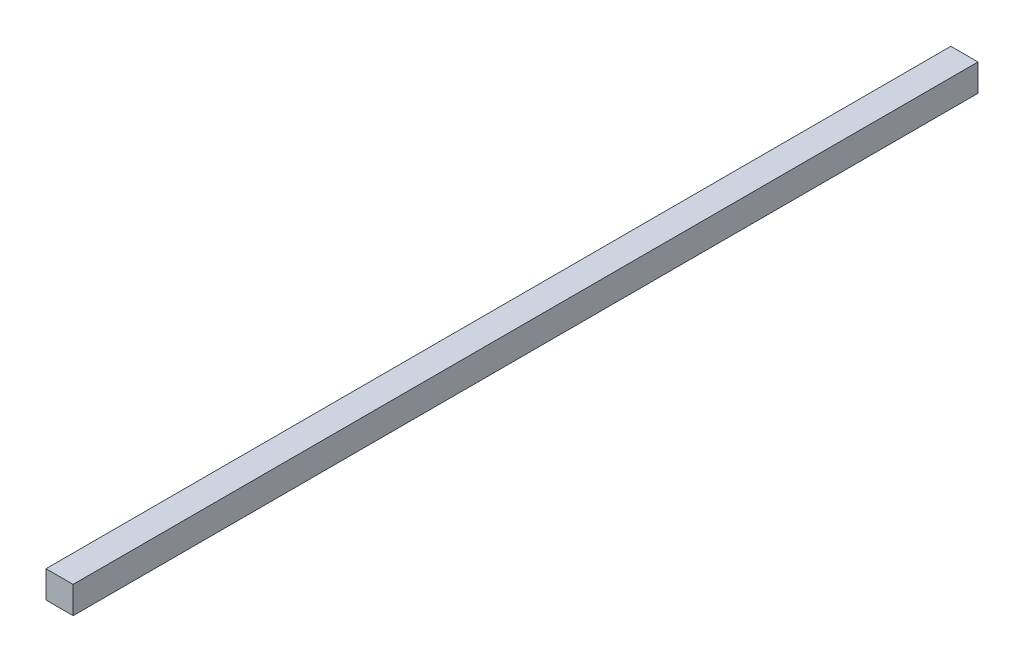
ISO-10303-21;
HEADER;
FILE_DESCRIPTION(('STEP AP214'),'2;1');
FILE_NAME('part.step','',(''),(''),'','','');
FILE_SCHEMA(('AUTOMOTIVE_DESIGN { 1 0 10303 214 1 1 1 1 }'));
ENDSEC;
DATA;
#1=APPLICATION_CONTEXT('core data for automotive mechanical design processes');
#2=APPLICATION_PROTOCOL_DEFINITION('international standard','automotive_design',2000,#1);
#3=PRODUCT_CONTEXT('',#1,'mechanical');
#4=PRODUCT('Part','Part','',(#3));
#5=PRODUCT_RELATED_PRODUCT_CATEGORY('part','',(#4));
#6=PRODUCT_DEFINITION_FORMATION('','',#4);
#7=PRODUCT_DEFINITION_CONTEXT('part definition',#1,'design');
#8=PRODUCT_DEFINITION('design','',#6,#7);
#9=PRODUCT_DEFINITION_SHAPE('','',#8);
#10=(LENGTH_UNIT() NAMED_UNIT(*) SI_UNIT(.MILLI.,.METRE.));
#11=(NAMED_UNIT(*) PLANE_ANGLE_UNIT() SI_UNIT($,.RADIAN.));
#12=(NAMED_UNIT(*) SI_UNIT($,.STERADIAN.) SOLID_ANGLE_UNIT());
#13=UNCERTAINTY_MEASURE_WITH_UNIT(LENGTH_MEASURE(1.E-05),#10,'distance_accuracy_value','');
#14=(GEOMETRIC_REPRESENTATION_CONTEXT(3) GLOBAL_UNCERTAINTY_ASSIGNED_CONTEXT((#13)) GLOBAL_UNIT_ASSIGNED_CONTEXT((#10,
#11,#12)) REPRESENTATION_CONTEXT('',''));
#15=CARTESIAN_POINT('',(0.,0.,0.));
#16=DIRECTION('',(0.,0.,1.));
#17=DIRECTION('',(1.,0.,0.));
#18=AXIS2_PLACEMENT_3D('',#15,#16,#17);
#19=CARTESIAN_POINT('',(0.,0.,100.));
#20=DIRECTION('',(1.,0.,0.));
#21=DIRECTION('',(0.,0.,-1.));
#22=AXIS2_PLACEMENT_3D('',#19,#20,#21);
#23=PLANE('',#22);
#24=DIRECTION('',(0.,-1.,0.));
#25=VECTOR('',#24,1.);
#26=CARTESIAN_POINT('',(0.,0.,0.));
#27=LINE('',#26,#25);
#28=CARTESIAN_POINT('',(0.,3.,0.));
#29=VERTEX_POINT('',#28);
#30=CARTESIAN_POINT('',(0.,0.,0.));
#31=VERTEX_POINT('',#30);
#32=EDGE_CURVE('E99',#29,#31,#27,.T.);
#33=ORIENTED_EDGE('',*,*,#32,.T.);
#34=DIRECTION('',(0.,0.,-1.));
#35=VECTOR('',#34,1.);
#36=CARTESIAN_POINT('',(0.,0.,100.));
#37=LINE('',#36,#35);
#38=CARTESIAN_POINT('',(0.,0.,100.));
#39=VERTEX_POINT('',#38);
#40=EDGE_CURVE('E11',#39,#31,#37,.T.);
#41=ORIENTED_EDGE('',*,*,#40,.F.);
#42=DIRECTION('',(0.,-1.,0.));
#43=VECTOR('',#42,1.);
#44=CARTESIAN_POINT('',(0.,0.,100.));
#45=LINE('',#44,#43);
#46=CARTESIAN_POINT('',(0.,3.,100.));
#47=VERTEX_POINT('',#46);
#48=EDGE_CURVE('E87',#47,#39,#45,.T.);
#49=ORIENTED_EDGE('',*,*,#48,.F.);
#50=DIRECTION('',(0.,0.,-1.));
#51=VECTOR('',#50,1.);
#52=CARTESIAN_POINT('',(0.,3.,100.));
#53=LINE('',#52,#51);
#54=EDGE_CURVE('E95',#47,#29,#53,.T.);
#55=ORIENTED_EDGE('',*,*,#54,.T.);
#56=EDGE_LOOP('',(#33,#41,#49,#55));
#57=FACE_BOUND('',#56,.T.);
#58=ADVANCED_FACE('F36',(#57),#23,.F.);
#59=CARTESIAN_POINT('',(0.,0.,100.));
#60=DIRECTION('',(0.,1.,0.));
#61=DIRECTION('',(0.,0.,1.));
#62=AXIS2_PLACEMENT_3D('',#59,#60,#61);
#63=PLANE('',#62);
#64=DIRECTION('',(1.,0.,0.));
#65=VECTOR('',#64,1.);
#66=CARTESIAN_POINT('',(0.,0.,0.));
#67=LINE('',#66,#65);
#68=CARTESIAN_POINT('',(3.,0.,0.));
#69=VERTEX_POINT('',#68);
#70=EDGE_CURVE('E91',#31,#69,#67,.T.);
#71=ORIENTED_EDGE('',*,*,#70,.T.);
#72=DIRECTION('',(0.,0.,-1.));
#73=VECTOR('',#72,1.);
#74=CARTESIAN_POINT('',(3.,0.,100.));
#75=LINE('',#74,#73);
#76=CARTESIAN_POINT('',(3.,0.,100.));
#77=VERTEX_POINT('',#76);
#78=EDGE_CURVE('E44',#77,#69,#75,.T.);
#79=ORIENTED_EDGE('',*,*,#78,.F.);
#80=DIRECTION('',(1.,0.,0.));
#81=VECTOR('',#80,1.);
#82=CARTESIAN_POINT('',(0.,0.,100.));
#83=LINE('',#82,#81);
#84=EDGE_CURVE('E82',#39,#77,#83,.T.);
#85=ORIENTED_EDGE('',*,*,#84,.F.);
#86=ORIENTED_EDGE('',*,*,#40,.T.);
#87=EDGE_LOOP('',(#71,#79,#85,#86));
#88=FACE_BOUND('',#87,.T.);
#89=ADVANCED_FACE('F90',(#88),#63,.F.);
#90=CARTESIAN_POINT('',(3.,0.,100.));
#91=DIRECTION('',(-1.,0.,0.));
#92=DIRECTION('',(0.,0.,1.));
#93=AXIS2_PLACEMENT_3D('',#90,#91,#92);
#94=PLANE('',#93);
#95=DIRECTION('',(0.,1.,0.));
#96=VECTOR('',#95,1.);
#97=CARTESIAN_POINT('',(3.,0.,0.));
#98=LINE('',#97,#96);
#99=CARTESIAN_POINT('',(3.,3.,0.));
#100=VERTEX_POINT('',#99);
#101=EDGE_CURVE('E69',#69,#100,#98,.T.);
#102=ORIENTED_EDGE('',*,*,#101,.T.);
#103=DIRECTION('',(0.,0.,-1.));
#104=VECTOR('',#103,1.);
#105=CARTESIAN_POINT('',(3.,3.,100.));
#106=LINE('',#105,#104);
#107=CARTESIAN_POINT('',(3.,3.,100.));
#108=VERTEX_POINT('',#107);
#109=EDGE_CURVE('E92',#108,#100,#106,.T.);
#110=ORIENTED_EDGE('',*,*,#109,.F.);
#111=DIRECTION('',(0.,1.,0.));
#112=VECTOR('',#111,1.);
#113=CARTESIAN_POINT('',(3.,0.,100.));
#114=LINE('',#113,#112);
#115=EDGE_CURVE('E85',#77,#108,#114,.T.);
#116=ORIENTED_EDGE('',*,*,#115,.F.);
#117=ORIENTED_EDGE('',*,*,#78,.T.);
#118=EDGE_LOOP('',(#102,#110,#116,#117));
#119=FACE_BOUND('',#118,.T.);
#120=ADVANCED_FACE('F93',(#119),#94,.F.);
#121=CARTESIAN_POINT('',(0.,3.,100.));
#122=DIRECTION('',(0.,-1.,0.));
#123=DIRECTION('',(0.,0.,-1.));
#124=AXIS2_PLACEMENT_3D('',#121,#122,#123);
#125=PLANE('',#124);
#126=DIRECTION('',(-1.,0.,0.));
#127=VECTOR('',#126,1.);
#128=CARTESIAN_POINT('',(0.,3.,0.));
#129=LINE('',#128,#127);
#130=EDGE_CURVE('E75',#100,#29,#129,.T.);
#131=ORIENTED_EDGE('',*,*,#130,.T.);
#132=ORIENTED_EDGE('',*,*,#54,.F.);
#133=DIRECTION('',(-1.,0.,0.));
#134=VECTOR('',#133,1.);
#135=CARTESIAN_POINT('',(0.,3.,100.));
#136=LINE('',#135,#134);
#137=EDGE_CURVE('E52',#108,#47,#136,.T.);
#138=ORIENTED_EDGE('',*,*,#137,.F.);
#139=ORIENTED_EDGE('',*,*,#109,.T.);
#140=EDGE_LOOP('',(#131,#132,#138,#139));
#141=FACE_BOUND('',#140,.T.);
#142=ADVANCED_FACE('F106',(#141),#125,.F.);
#143=CARTESIAN_POINT('',(0.,0.,100.));
#144=DIRECTION('',(0.,0.,-1.));
#145=DIRECTION('',(-1.,0.,0.));
#146=AXIS2_PLACEMENT_3D('',#143,#144,#145);
#147=PLANE('',#146);
#148=ORIENTED_EDGE('',*,*,#48,.T.);
#149=ORIENTED_EDGE('',*,*,#84,.T.);
#150=ORIENTED_EDGE('',*,*,#115,.T.);
#151=ORIENTED_EDGE('',*,*,#137,.T.);
#152=EDGE_LOOP('',(#148,#149,#150,#151));
#153=FACE_BOUND('',#152,.T.);
#154=ADVANCED_FACE('F83',(#153),#147,.F.);
#155=CARTESIAN_POINT('',(0.,0.,0.));
#156=DIRECTION('',(0.,0.,-1.));
#157=DIRECTION('',(-1.,0.,0.));
#158=AXIS2_PLACEMENT_3D('',#155,#156,#157);
#159=PLANE('',#158);
#160=ORIENTED_EDGE('',*,*,#32,.F.);
#161=ORIENTED_EDGE('',*,*,#130,.F.);
#162=ORIENTED_EDGE('',*,*,#101,.F.);
#163=ORIENTED_EDGE('',*,*,#70,.F.);
#164=EDGE_LOOP('',(#160,#161,#162,#163));
#165=FACE_BOUND('',#164,.T.);
#166=ADVANCED_FACE('F109',(#165),#159,.T.);
#167=CLOSED_SHELL('',(#58,#89,#120,#142,#154,#166));
#168=MANIFOLD_SOLID_BREP('B2',#167);
#169=ADVANCED_BREP_SHAPE_REPRESENTATION('',(#18,#168),#14);
#170=SHAPE_DEFINITION_REPRESENTATION(#9,#169);
ENDSEC;
END-ISO-10303-21;
